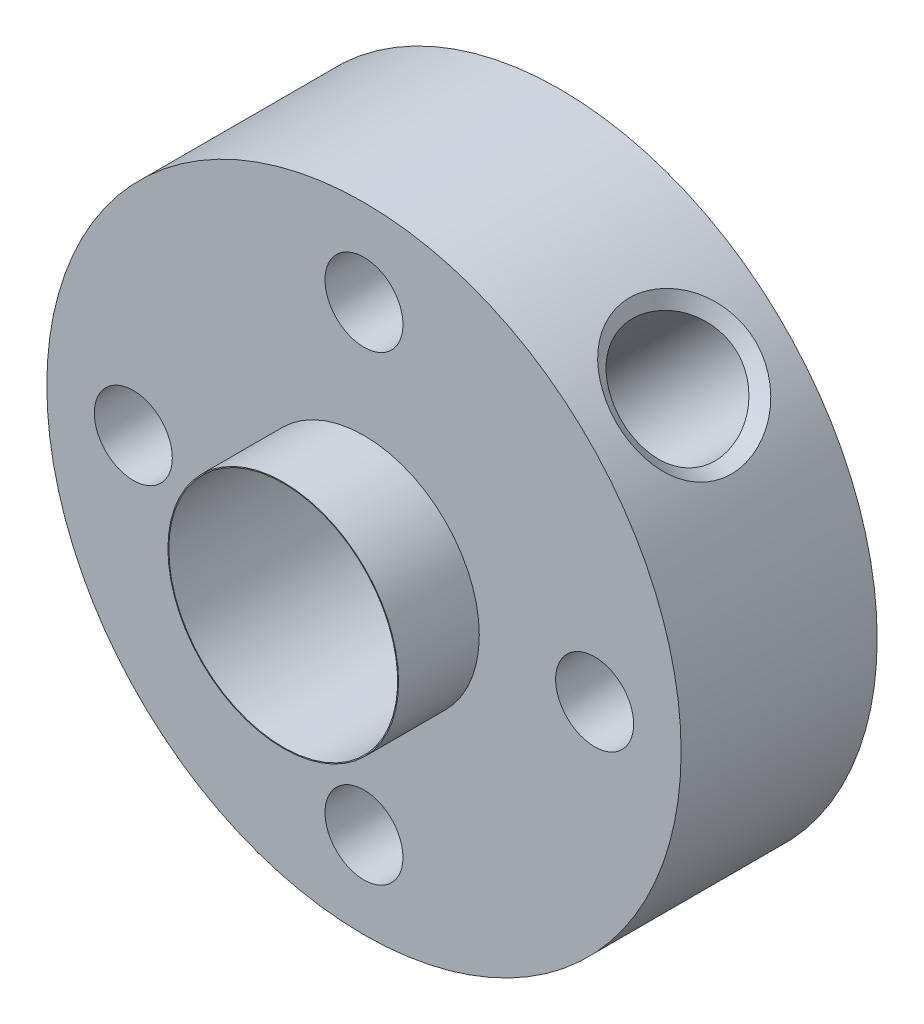
ISO-10303-21;
HEADER;
FILE_DESCRIPTION(('STEP AP214'),'2;1');
FILE_NAME('part.step','',(''),(''),'','','');
FILE_SCHEMA(('AUTOMOTIVE_DESIGN { 1 0 10303 214 1 1 1 1 }'));
ENDSEC;
DATA;
#1=APPLICATION_CONTEXT('core data for automotive mechanical design processes');
#2=APPLICATION_PROTOCOL_DEFINITION('international standard','automotive_design',2000,#1);
#3=PRODUCT_CONTEXT('',#1,'mechanical');
#4=PRODUCT('Part','Part','',(#3));
#5=PRODUCT_RELATED_PRODUCT_CATEGORY('part','',(#4));
#6=PRODUCT_DEFINITION_FORMATION('','',#4);
#7=PRODUCT_DEFINITION_CONTEXT('part definition',#1,'design');
#8=PRODUCT_DEFINITION('design','',#6,#7);
#9=PRODUCT_DEFINITION_SHAPE('','',#8);
#10=(LENGTH_UNIT() NAMED_UNIT(*) SI_UNIT(.MILLI.,.METRE.));
#11=(NAMED_UNIT(*) PLANE_ANGLE_UNIT() SI_UNIT($,.RADIAN.));
#12=(NAMED_UNIT(*) SI_UNIT($,.STERADIAN.) SOLID_ANGLE_UNIT());
#13=UNCERTAINTY_MEASURE_WITH_UNIT(LENGTH_MEASURE(1.E-05),#10,'distance_accuracy_value','');
#14=(GEOMETRIC_REPRESENTATION_CONTEXT(3) GLOBAL_UNCERTAINTY_ASSIGNED_CONTEXT((#13)) GLOBAL_UNIT_ASSIGNED_CONTEXT((#10,
#11,#12)) REPRESENTATION_CONTEXT('',''));
#15=CARTESIAN_POINT('',(0.,0.,0.));
#16=DIRECTION('',(0.,0.,1.));
#17=DIRECTION('',(1.,0.,0.));
#18=AXIS2_PLACEMENT_3D('',#15,#16,#17);
#19=CARTESIAN_POINT('',(0.,0.,3.4));
#20=DIRECTION('',(0.,0.,1.));
#21=DIRECTION('',(1.,0.,0.));
#22=AXIS2_PLACEMENT_3D('',#19,#20,#21);
#23=PLANE('',#22);
#24=CARTESIAN_POINT('',(0.,8.,3.4));
#25=DIRECTION('',(0.,0.,1.));
#26=DIRECTION('',(1.,0.,0.));
#27=AXIS2_PLACEMENT_3D('',#24,#25,#26);
#28=CIRCLE('',#27,1.35254999999999);
#29=CARTESIAN_POINT('',(1.35254999999999,8.,3.4));
#30=VERTEX_POINT('',#29);
#31=EDGE_CURVE('E193',#30,#30,#28,.T.);
#32=ORIENTED_EDGE('',*,*,#31,.F.);
#33=EDGE_LOOP('',(#32));
#34=FACE_BOUND('',#33,.T.);
#35=CARTESIAN_POINT('',(-8.,0.,3.4));
#36=DIRECTION('',(0.,0.,1.));
#37=DIRECTION('',(1.,0.,0.));
#38=AXIS2_PLACEMENT_3D('',#35,#36,#37);
#39=CIRCLE('',#38,1.35254999999999);
#40=CARTESIAN_POINT('',(-6.64745000000001,0.,3.4));
#41=VERTEX_POINT('',#40);
#42=EDGE_CURVE('E170',#41,#41,#39,.T.);
#43=ORIENTED_EDGE('',*,*,#42,.F.);
#44=EDGE_LOOP('',(#43));
#45=FACE_BOUND('',#44,.T.);
#46=CARTESIAN_POINT('',(8.,0.,3.4));
#47=DIRECTION('',(0.,0.,1.));
#48=DIRECTION('',(1.,0.,0.));
#49=AXIS2_PLACEMENT_3D('',#46,#47,#48);
#50=CIRCLE('',#49,1.35254999999999);
#51=CARTESIAN_POINT('',(9.35254999999999,0.,3.4));
#52=VERTEX_POINT('',#51);
#53=EDGE_CURVE('E163',#52,#52,#50,.T.);
#54=ORIENTED_EDGE('',*,*,#53,.F.);
#55=EDGE_LOOP('',(#54));
#56=FACE_BOUND('',#55,.T.);
#57=CARTESIAN_POINT('',(0.,-8.,3.4));
#58=DIRECTION('',(0.,0.,1.));
#59=DIRECTION('',(1.,0.,0.));
#60=AXIS2_PLACEMENT_3D('',#57,#58,#59);
#61=CIRCLE('',#60,1.35254999999999);
#62=CARTESIAN_POINT('',(1.35254999999999,-8.,3.4));
#63=VERTEX_POINT('',#62);
#64=EDGE_CURVE('E168',#63,#63,#61,.T.);
#65=ORIENTED_EDGE('',*,*,#64,.F.);
#66=EDGE_LOOP('',(#65));
#67=FACE_BOUND('',#66,.T.);
#68=CARTESIAN_POINT('',(0.,0.,3.4));
#69=DIRECTION('',(0.,0.,1.));
#70=DIRECTION('',(1.,0.,0.));
#71=AXIS2_PLACEMENT_3D('',#68,#69,#70);
#72=CIRCLE('',#71,11.);
#73=CARTESIAN_POINT('',(11.,0.,3.4));
#74=VERTEX_POINT('',#73);
#75=EDGE_CURVE('E60',#74,#74,#72,.T.);
#76=ORIENTED_EDGE('',*,*,#75,.T.);
#77=EDGE_LOOP('',(#76));
#78=FACE_BOUND('',#77,.T.);
#79=CARTESIAN_POINT('',(0.,0.,3.4));
#80=DIRECTION('',(0.,0.,1.));
#81=DIRECTION('',(1.,0.,0.));
#82=AXIS2_PLACEMENT_3D('',#79,#80,#81);
#83=CIRCLE('',#82,4.);
#84=CARTESIAN_POINT('',(4.,0.,3.4));
#85=VERTEX_POINT('',#84);
#86=EDGE_CURVE('E68',#85,#85,#83,.T.);
#87=ORIENTED_EDGE('',*,*,#86,.F.);
#88=EDGE_LOOP('',(#87));
#89=FACE_BOUND('',#88,.T.);
#90=ADVANCED_FACE('F35',(#34,#45,#56,#67,#78,#89),#23,.T.);
#91=CARTESIAN_POINT('',(0.,0.,-3.4));
#92=DIRECTION('',(0.,0.,1.));
#93=DIRECTION('',(1.,0.,0.));
#94=AXIS2_PLACEMENT_3D('',#91,#92,#93);
#95=CYLINDRICAL_SURFACE('',#94,11.);
#96=CARTESIAN_POINT('',(5.80850921114971,9.34137145948008,0.));
#97=CARTESIAN_POINT('',(5.80860175270186,9.34130684226353,0.637752239425181));
#98=CARTESIAN_POINT('',(6.04841944563921,9.19795689630477,1.26506432985481));
#99=CARTESIAN_POINT('',(6.80772994268232,8.6547578245762,2.1593530444314));
#100=CARTESIAN_POINT('',(7.31255506753503,8.24383991985221,2.42181611028022));
#101=CARTESIAN_POINT('',(8.24208780154512,7.31421539613681,2.42137394363942));
#102=CARTESIAN_POINT('',(8.65342910417239,6.80927509037896,2.16023058528547));
#103=CARTESIAN_POINT('',(9.19833006953286,6.04820111625001,1.26575073384544));
#104=CARTESIAN_POINT('',(9.34130756360716,5.80859981124356,0.640244269694806));
#105=CARTESIAN_POINT('',(9.34143535072448,5.80841861849953,-0.63996115444348));
#106=CARTESIAN_POINT('',(9.19862099961548,6.04773368941902,-1.26485137218771));
#107=CARTESIAN_POINT('',(8.65403117260026,6.8085025567722,-2.15966842361701));
#108=CARTESIAN_POINT('',(8.24214650834189,7.31418190369821,-2.42143639363606));
#109=CARTESIAN_POINT('',(7.31242801405934,8.24394174367863,-2.42175361413118));
#110=CARTESIAN_POINT('',(6.80825671047602,8.65433029295559,-2.15959971653594));
#111=CARTESIAN_POINT('',(6.04869975760828,9.19780320357039,-1.26576913530237));
#112=CARTESIAN_POINT('',(5.80841666959755,9.34143607669663,-0.637752239425181));
#113=CARTESIAN_POINT('',(5.80850921114971,9.34137145948008,0.));
#114=B_SPLINE_CURVE_WITH_KNOTS('',3,(#96,#97,#98,#99,#100,#101,#102,#103,#104,#105,#106,#107,
#108,#109,#110,#111,#112,#113),.UNSPECIFIED.,.T.,.F.,(4,2,2,2,2,2,2,2,4),(-3.18999496817969E-06,
0.00189587305523978,0.00379493610544773,0.00569399915565569,0.00759306220586365,
0.0094921252560716,0.0113911883062796,0.0132902513564875,0.0151893144066955),.UNSPECIFIED.);
#115=CARTESIAN_POINT('',(5.80850921114971,9.34137145948008,0.));
#116=VERTEX_POINT('',#115);
#117=EDGE_CURVE('E10',#116,#116,#114,.F.);
#118=ORIENTED_EDGE('',*,*,#117,.T.);
#119=EDGE_LOOP('',(#118));
#120=FACE_BOUND('',#119,.T.);
#121=CARTESIAN_POINT('',(0.,0.,-3.4));
#122=DIRECTION('',(0.,0.,1.));
#123=DIRECTION('',(1.,0.,0.));
#124=AXIS2_PLACEMENT_3D('',#121,#122,#123);
#125=CIRCLE('',#124,11.);
#126=CARTESIAN_POINT('',(11.,0.,-3.4));
#127=VERTEX_POINT('',#126);
#128=EDGE_CURVE('E55',#127,#127,#125,.T.);
#129=ORIENTED_EDGE('',*,*,#128,.T.);
#130=EDGE_LOOP('',(#129));
#131=FACE_BOUND('',#130,.T.);
#132=ORIENTED_EDGE('',*,*,#75,.F.);
#133=EDGE_LOOP('',(#132));
#134=FACE_BOUND('',#133,.T.);
#135=ADVANCED_FACE('F99',(#120,#131,#134),#95,.T.);
#136=CARTESIAN_POINT('',(0.,0.,-3.4));
#137=DIRECTION('',(0.,0.,1.));
#138=DIRECTION('',(1.,0.,0.));
#139=AXIS2_PLACEMENT_3D('',#136,#137,#138);
#140=PLANE('',#139);
#141=CARTESIAN_POINT('',(0.,0.,-3.4));
#142=DIRECTION('',(0.,0.,-1.));
#143=DIRECTION('',(-1.,0.,0.));
#144=AXIS2_PLACEMENT_3D('',#141,#142,#143);
#145=CIRCLE('',#144,3.96875);
#146=CARTESIAN_POINT('',(-3.96875,0.,-3.4));
#147=VERTEX_POINT('',#146);
#148=EDGE_CURVE('E199',#147,#147,#145,.T.);
#149=ORIENTED_EDGE('',*,*,#148,.F.);
#150=EDGE_LOOP('',(#149));
#151=FACE_BOUND('',#150,.T.);
#152=CARTESIAN_POINT('',(0.,8.,-3.4));
#153=DIRECTION('',(0.,0.,1.));
#154=DIRECTION('',(1.,0.,0.));
#155=AXIS2_PLACEMENT_3D('',#152,#153,#154);
#156=CIRCLE('',#155,1.35255);
#157=CARTESIAN_POINT('',(1.35255,8.,-3.4));
#158=VERTEX_POINT('',#157);
#159=EDGE_CURVE('E196',#158,#158,#156,.T.);
#160=ORIENTED_EDGE('',*,*,#159,.T.);
#161=EDGE_LOOP('',(#160));
#162=FACE_BOUND('',#161,.T.);
#163=CARTESIAN_POINT('',(-8.,0.,-3.4));
#164=DIRECTION('',(0.,0.,1.));
#165=DIRECTION('',(1.,0.,0.));
#166=AXIS2_PLACEMENT_3D('',#163,#164,#165);
#167=CIRCLE('',#166,1.35255);
#168=CARTESIAN_POINT('',(-6.64745,0.,-3.4));
#169=VERTEX_POINT('',#168);
#170=EDGE_CURVE('E190',#169,#169,#167,.T.);
#171=ORIENTED_EDGE('',*,*,#170,.T.);
#172=EDGE_LOOP('',(#171));
#173=FACE_BOUND('',#172,.T.);
#174=CARTESIAN_POINT('',(8.,0.,-3.4));
#175=DIRECTION('',(0.,0.,1.));
#176=DIRECTION('',(1.,0.,0.));
#177=AXIS2_PLACEMENT_3D('',#174,#175,#176);
#178=CIRCLE('',#177,1.35255);
#179=CARTESIAN_POINT('',(9.35255,0.,-3.4));
#180=VERTEX_POINT('',#179);
#181=EDGE_CURVE('E160',#180,#180,#178,.T.);
#182=ORIENTED_EDGE('',*,*,#181,.T.);
#183=EDGE_LOOP('',(#182));
#184=FACE_BOUND('',#183,.T.);
#185=CARTESIAN_POINT('',(0.,-8.,-3.4));
#186=DIRECTION('',(0.,0.,1.));
#187=DIRECTION('',(1.,0.,0.));
#188=AXIS2_PLACEMENT_3D('',#185,#186,#187);
#189=CIRCLE('',#188,1.35255);
#190=CARTESIAN_POINT('',(1.35255,-8.,-3.4));
#191=VERTEX_POINT('',#190);
#192=EDGE_CURVE('E165',#191,#191,#189,.T.);
#193=ORIENTED_EDGE('',*,*,#192,.T.);
#194=EDGE_LOOP('',(#193));
#195=FACE_BOUND('',#194,.T.);
#196=ORIENTED_EDGE('',*,*,#128,.F.);
#197=EDGE_LOOP('',(#196));
#198=FACE_BOUND('',#197,.T.);
#199=ADVANCED_FACE('F95',(#151,#162,#173,#184,#195,#198),#140,.F.);
#200=CARTESIAN_POINT('',(0.,0.,6.2));
#201=DIRECTION('',(0.,0.,-1.));
#202=DIRECTION('',(-1.,0.,0.));
#203=AXIS2_PLACEMENT_3D('',#200,#201,#202);
#204=CYLINDRICAL_SURFACE('',#203,4.);
#205=CARTESIAN_POINT('',(0.,0.,6.2));
#206=DIRECTION('',(0.,0.,1.));
#207=DIRECTION('',(1.,0.,0.));
#208=AXIS2_PLACEMENT_3D('',#205,#206,#207);
#209=CIRCLE('',#208,4.);
#210=CARTESIAN_POINT('',(4.,0.,6.2));
#211=VERTEX_POINT('',#210);
#212=EDGE_CURVE('E65',#211,#211,#209,.T.);
#213=ORIENTED_EDGE('',*,*,#212,.F.);
#214=EDGE_LOOP('',(#213));
#215=FACE_BOUND('',#214,.T.);
#216=ORIENTED_EDGE('',*,*,#86,.T.);
#217=EDGE_LOOP('',(#216));
#218=FACE_BOUND('',#217,.T.);
#219=ADVANCED_FACE('F91',(#215,#218),#204,.T.);
#220=CARTESIAN_POINT('',(0.,0.,6.2));
#221=DIRECTION('',(0.,0.,1.));
#222=DIRECTION('',(1.,0.,0.));
#223=AXIS2_PLACEMENT_3D('',#220,#221,#222);
#224=PLANE('',#223);
#225=CARTESIAN_POINT('',(0.,0.,6.2));
#226=DIRECTION('',(0.,0.,-1.));
#227=DIRECTION('',(-1.,0.,0.));
#228=AXIS2_PLACEMENT_3D('',#225,#226,#227);
#229=CIRCLE('',#228,3.96875);
#230=CARTESIAN_POINT('',(-3.96875,0.,6.2));
#231=VERTEX_POINT('',#230);
#232=EDGE_CURVE('E202',#231,#231,#229,.T.);
#233=ORIENTED_EDGE('',*,*,#232,.T.);
#234=EDGE_LOOP('',(#233));
#235=FACE_BOUND('',#234,.T.);
#236=ORIENTED_EDGE('',*,*,#212,.T.);
#237=EDGE_LOOP('',(#236));
#238=FACE_BOUND('',#237,.T.);
#239=ADVANCED_FACE('F85',(#235,#238),#224,.T.);
#240=CARTESIAN_POINT('',(7.77817459305204,7.77817459305201,0.));
#241=DIRECTION('',(0.707106781186549,0.707106781186546,0.));
#242=DIRECTION('',(-0.707106781186546,0.707106781186549,0.));
#243=AXIS2_PLACEMENT_3D('',#240,#241,#242);
#244=CYLINDRICAL_SURFACE('',#243,2.01929999999999);
#245=CARTESIAN_POINT('',(0.988066021552105,3.84378746805208,0.));
#246=CARTESIAN_POINT('',(0.988079902541116,3.84378895007629,-0.104927856551473));
#247=CARTESIAN_POINT('',(0.997359113943263,3.84143565622422,-0.209985951877966));
#248=CARTESIAN_POINT('',(1.0336680659886,3.83181885188441,-0.416851766777405));
#249=CARTESIAN_POINT('',(1.06073378291078,3.82454538862704,-0.518652459109407));
#250=CARTESIAN_POINT('',(1.13022299693377,3.80458397320029,-0.715620498990883));
#251=CARTESIAN_POINT('',(1.17256250905059,3.79192556393313,-0.810820791319396));
#252=CARTESIAN_POINT('',(1.26993094348076,3.7604338013933,-0.993320316996598));
#253=CARTESIAN_POINT('',(1.32496093160809,3.7415999294162,-1.08061888585833));
#254=CARTESIAN_POINT('',(1.4502174154329,3.6949530461915,-1.25308159207338));
#255=CARTESIAN_POINT('',(1.52134137800284,3.66650955234386,-1.33742373732139));
#256=CARTESIAN_POINT('',(1.6723052454782,3.60016282906435,-1.49374573019937));
#257=CARTESIAN_POINT('',(1.75214959794203,3.56225475973178,-1.56571922097949));
#258=CARTESIAN_POINT('',(1.92334854127002,3.47298942710685,-1.70022656254003));
#259=CARTESIAN_POINT('',(2.0151177350485,3.42087311221871,-1.76173889279822));
#260=CARTESIAN_POINT('',(2.20120105356201,3.30419656521406,-1.86639760992893));
#261=CARTESIAN_POINT('',(2.29551347325045,3.23964450033303,-1.90955599149708));
#262=CARTESIAN_POINT('',(2.47562329768691,3.10387451128039,-1.97299149618751));
#263=CARTESIAN_POINT('',(2.56153840302111,3.03349117405402,-1.99471305588314));
#264=CARTESIAN_POINT('',(2.72850970041959,2.88421930798347,-2.01942570035066));
#265=CARTESIAN_POINT('',(2.80956892130637,2.80533616861374,-2.02242858381395));
#266=CARTESIAN_POINT('',(2.95694466876338,2.64914129463903,-2.01015199009899));
#267=CARTESIAN_POINT('',(3.02393145385512,2.57232673696917,-1.99649311009036));
#268=CARTESIAN_POINT('',(3.14995684203534,2.41636142335379,-1.95419547289651));
#269=CARTESIAN_POINT('',(3.20899484801796,2.33721049244571,-1.92555559113911));
#270=CARTESIAN_POINT('',(3.31908779594535,2.17810180971991,-1.85395095981867));
#271=CARTESIAN_POINT('',(3.37002491830902,2.09814749264745,-1.81079905149489));
#272=CARTESIAN_POINT('',(3.46290403064263,1.94103413705174,-1.71166853890331));
#273=CARTESIAN_POINT('',(3.50484283192848,1.86387609745267,-1.65568540219259));
#274=CARTESIAN_POINT('',(3.58382388815285,1.70750678416115,-1.5262546139572));
#275=CARTESIAN_POINT('',(3.6199970261924,1.62882188057161,-1.45163987808151));
#276=CARTESIAN_POINT('',(3.68305818293236,1.48072646230621,-1.2901734015466));
#277=CARTESIAN_POINT('',(3.70993863236889,1.41132353624781,-1.20331176599065));
#278=CARTESIAN_POINT('',(3.75708089385763,1.28080324032226,-1.01266300006346));
#279=CARTESIAN_POINT('',(3.77677370342606,1.2205609670457,-0.908129278653181));
#280=CARTESIAN_POINT('',(3.80819276088697,1.11871027030587,-0.689253213204129));
#281=CARTESIAN_POINT('',(3.8199275534277,1.07708187724419,-0.5749215384806));
#282=CARTESIAN_POINT('',(3.83586302371067,1.01881432623523,-0.34929245092863));
#283=CARTESIAN_POINT('',(3.84059152655263,1.00044180772154,-0.238484555747577));
#284=CARTESIAN_POINT('',(3.84467034847992,0.984666788253275,-0.0153190940584517));
#285=CARTESIAN_POINT('',(3.84402479071221,0.987248210743565,0.0970372183887347));
#286=CARTESIAN_POINT('',(3.83768926688075,1.01154768021783,0.306285889223869));
#287=CARTESIAN_POINT('',(3.83258914996281,1.03102629884983,0.403468276542668));
#288=CARTESIAN_POINT('',(3.81777315440258,1.08459721795761,0.593338244190524));
#289=CARTESIAN_POINT('',(3.80805571029018,1.11869447438943,0.686024288313387));
#290=CARTESIAN_POINT('',(3.78285711500173,1.2012088615821,0.869141295505289));
#291=CARTESIAN_POINT('',(3.76713121285843,1.25021297597341,0.959271996815907));
#292=CARTESIAN_POINT('',(3.72917596633653,1.35924768170892,1.13110010124883));
#293=CARTESIAN_POINT('',(3.70694326990453,1.4192839504532,1.21279312818116));
#294=CARTESIAN_POINT('',(3.65168327891227,1.55638441929068,1.37666632676823));
#295=CARTESIAN_POINT('',(3.61762119365603,1.63464956857404,1.45749894372438));
#296=CARTESIAN_POINT('',(3.5388740045432,1.79878642690377,1.60513146946906));
#297=CARTESIAN_POINT('',(3.49418491253164,1.88466098403699,1.6719260922397));
#298=CARTESIAN_POINT('',(3.39186160946718,2.06328504915796,1.7913214795364));
#299=CARTESIAN_POINT('',(3.33387882619923,2.15616359207096,1.8434355346827));
#300=CARTESIAN_POINT('',(3.20579420795771,2.34234537613327,1.928449225566));
#301=CARTESIAN_POINT('',(3.13570345543774,2.43564815359813,1.96136631281111));
#302=CARTESIAN_POINT('',(2.99180655270109,2.60990913364403,2.00412288627952));
#303=CARTESIAN_POINT('',(2.91896496918987,2.69120453013022,2.01583680402984));
#304=CARTESIAN_POINT('',(2.76644500483723,2.84775021696145,2.02143522084023));
#305=CARTESIAN_POINT('',(2.686769207402,2.92300277091989,2.01532642849873));
#306=CARTESIAN_POINT('',(2.52910686050123,3.06019007046344,1.98666783402269));
#307=CARTESIAN_POINT('',(2.45139014021031,3.1226876327281,1.96529456057147));
#308=CARTESIAN_POINT('',(2.29496968590167,3.23938550840543,1.90833748226343));
#309=CARTESIAN_POINT('',(2.21626581647025,3.29358466970137,1.87275170667011));
#310=CARTESIAN_POINT('',(2.05709684530155,3.39538335267928,1.78685660207556));
#311=CARTESIAN_POINT('',(1.97669508431021,3.44261359261191,1.73599535996841));
#312=CARTESIAN_POINT('',(1.82009903391039,3.52791441376144,1.62168189898446));
#313=CARTESIAN_POINT('',(1.74390668086039,3.56598080613233,1.55822394617094));
#314=CARTESIAN_POINT('',(1.59073453119501,3.63708393211849,1.41297927787462));
#315=CARTESIAN_POINT('',(1.51447512494284,3.66920466515798,1.32998035162024));
#316=CARTESIAN_POINT('',(1.37341431743566,3.72430605957277,1.1519500326916));
#317=CARTESIAN_POINT('',(1.30862369799624,3.74727814538314,1.05690746026233));
#318=CARTESIAN_POINT('',(1.19205946451786,3.78601440655319,0.852732732091955));
#319=CARTESIAN_POINT('',(1.14085832928895,3.80147936469973,0.743208524542079));
#320=CARTESIAN_POINT('',(1.07955124122097,3.81916083666133,0.573071983833453));
#321=CARTESIAN_POINT('',(1.0617070600374,3.82413333843385,0.51543906059989));
#322=CARTESIAN_POINT('',(1.03157037760657,3.83237342500356,0.398634079647874));
#323=CARTESIAN_POINT('',(1.01927404506659,3.83564218663078,0.339463114045018));
#324=CARTESIAN_POINT('',(1.00268476754273,3.84000721976838,0.233567736576123));
#325=CARTESIAN_POINT('',(0.997213623023875,3.8414268032206,0.187038031107454));
#326=CARTESIAN_POINT('',(0.989901029667684,3.84331662818391,0.09368088626919));
#327=CARTESIAN_POINT('',(0.988059823275215,3.84378680628393,0.0468534272220681));
#328=CARTESIAN_POINT('',(0.988066021552105,3.84378746805208,0.));
#329=B_SPLINE_CURVE_WITH_KNOTS('',3,(#245,#246,#247,#248,#249,#250,#251,#252,#253,#254,#255,
#256,#257,#258,#259,#260,#261,#262,#263,#264,#265,#266,#267,#268,#269,#270,#271,#272,#273,#274,
#275,#276,#277,#278,#279,#280,#281,#282,#283,#284,#285,#286,#287,#288,#289,#290,#291,#292,#293,
#294,#295,#296,#297,#298,#299,#300,#301,#302,#303,#304,#305,#306,#307,#308,#309,#310,#311,#312,
#313,#314,#315,#316,#317,#318,#319,#320,#321,#322,#323,#324,#325,#326,#327,#328),.UNSPECIFIED.,
.T.,.F.,(4,2,2,2,2,2,2,2,2,2,2,2,2,2,2,2,2,2,2,2,2,2,2,2,2,2,2,2,2,2,2,2,2,2,2,2,2,2,2,2,2,4),
(0.,0.314593776156156,0.629825839217224,0.943350337013717,1.25690117586846,1.59728492965321,
1.93784310329725,2.30238105637919,2.66668040869054,3.00429585897964,3.34169848312726,
3.64874422629698,3.95581302164109,4.26700442383124,4.57830591968884,4.91979290400179,
5.26155739123993,5.62638332394284,5.99081691444654,6.32608302237147,6.66109192739968,
6.95749709235776,7.25400282304617,7.56415893350387,7.8744751067143,8.22558245452992,
8.57682177615261,8.9386132974231,9.30007540784798,9.62764581054904,9.95509292926405,
10.2596996913262,10.5643487054978,10.8816969366481,11.199189955173,11.549239007761,
11.8996154139391,12.2629980465975,12.4443643777116,12.6256052664879,12.7660714182122,
12.9065469514031),.UNSPECIFIED.);
#330=CARTESIAN_POINT('',(0.988066021552105,3.84378746805208,0.));
#331=VERTEX_POINT('',#330);
#332=EDGE_CURVE('E42',#331,#331,#329,.T.);
#333=ORIENTED_EDGE('',*,*,#332,.T.);
#334=EDGE_LOOP('',(#333));
#335=FACE_BOUND('',#334,.T.);
#336=CARTESIAN_POINT('',(5.91506401697902,8.77078546347897,0.));
#337=CARTESIAN_POINT('',(5.91505848231522,8.77078895441069,-0.0332110676748999));
#338=CARTESIAN_POINT('',(5.91584250371787,8.77036908136088,-0.0664205027333981));
#339=CARTESIAN_POINT('',(5.91894801804012,8.7686844720424,-0.132706000824386));
#340=CARTESIAN_POINT('',(5.9212676546673,8.76742075581777,-0.165782176435799));
#341=CARTESIAN_POINT('',(5.92740096477233,8.76405141279832,-0.231730396913026));
#342=CARTESIAN_POINT('',(5.93121367555311,8.7619463284787,-0.264602559475331));
#343=CARTESIAN_POINT('',(5.94028892447994,8.75689761117119,-0.33007339450581));
#344=CARTESIAN_POINT('',(5.94555114052323,8.7539541644756,-0.362672126078199));
#345=CARTESIAN_POINT('',(5.95748172497235,8.74723181556498,-0.427526437618046));
#346=CARTESIAN_POINT('',(5.96415019887331,8.74345285066972,-0.45978199165009));
#347=CARTESIAN_POINT('',(5.97884975539384,8.73506249034032,-0.523880394046921));
#348=CARTESIAN_POINT('',(5.9868811988934,8.73045087442044,-0.55572313069829));
#349=CARTESIAN_POINT('',(6.00426333819006,8.72039813550142,-0.618926309415734));
#350=CARTESIAN_POINT('',(6.01361451659092,8.71495670899628,-0.650286570375661));
#351=CARTESIAN_POINT('',(6.03359289306655,8.70324720139475,-0.712455190591757));
#352=CARTESIAN_POINT('',(6.04422059736454,8.69697879224988,-0.743263325292279));
#353=CARTESIAN_POINT('',(6.0667088867097,8.68361811087547,-0.804258051751251));
#354=CARTESIAN_POINT('',(6.07856993563722,8.67652552854269,-0.834444404496169));
#355=CARTESIAN_POINT('',(6.10348184418441,8.66151925847353,-0.894125891486483));
#356=CARTESIAN_POINT('',(6.11653308800739,8.65360530547822,-0.923620798638439));
#357=CARTESIAN_POINT('',(6.1437823270195,8.63695899466251,-0.981849692064878));
#358=CARTESIAN_POINT('',(6.15798061459985,8.62822642807899,-1.01058348182968));
#359=CARTESIAN_POINT('',(6.18748098358666,8.60994569245589,-1.0672204054046));
#360=CARTESIAN_POINT('',(6.20278327541986,8.60039736786602,-1.09512337941919));
#361=CARTESIAN_POINT('',(6.23444834486616,8.58048749877547,-1.15002897367341));
#362=CARTESIAN_POINT('',(6.25081127954805,8.57012583378044,-1.1770314596605));
#363=CARTESIAN_POINT('',(6.28455556770698,8.54859326407029,-1.23006622575013));
#364=CARTESIAN_POINT('',(6.30193706947595,8.53742224146554,-1.25609836367373));
#365=CARTESIAN_POINT('',(6.33767164204863,8.51426907303072,-1.30712323462615));
#366=CARTESIAN_POINT('',(6.35602490834891,8.50228676385234,-1.33211575668861));
#367=CARTESIAN_POINT('',(6.39367379710447,8.47753119815555,-1.38098995191832));
#368=CARTESIAN_POINT('',(6.41296973283743,8.46475767831074,-1.40487125057306));
#369=CARTESIAN_POINT('',(6.45239380966424,8.43836765389059,-1.45144277207452));
#370=CARTESIAN_POINT('',(6.47252179241437,8.42475130946692,-1.47413321969915));
#371=CARTESIAN_POINT('',(6.51347588006849,8.39664993352501,-1.51827896365428));
#372=CARTESIAN_POINT('',(6.53430150189428,8.38216549784592,-1.53973508781516));
#373=CARTESIAN_POINT('',(6.57659692078657,8.35237560191873,-1.58137915482344));
#374=CARTESIAN_POINT('',(6.59806639414691,8.33707055129587,-1.60156771966927));
#375=CARTESIAN_POINT('',(6.64157796071985,8.30566497179513,-1.6406458230446));
#376=CARTESIAN_POINT('',(6.66361982921346,8.28956475292207,-1.65953586105512));
#377=CARTESIAN_POINT('',(6.70820943365554,8.25660020779171,-1.69598536565465));
#378=CARTESIAN_POINT('',(6.73075699607695,8.23973614168033,-1.71354527988382));
#379=CARTESIAN_POINT('',(6.77629000761415,8.20527364445819,-1.74730308237523));
#380=CARTESIAN_POINT('',(6.79927530942779,8.18767545809095,-1.76350141922007));
#381=CARTESIAN_POINT('',(6.84561618019305,8.15177485327989,-1.79450451369917));
#382=CARTESIAN_POINT('',(6.86897161775489,8.13347268158226,-1.80930975345407));
#383=CARTESIAN_POINT('',(6.915985056941,8.09619410943874,-1.8374950782937));
#384=CARTESIAN_POINT('',(6.93964294335845,8.07721796109372,-1.8508756889275));
#385=CARTESIAN_POINT('',(6.98719359976604,8.03862146663374,-1.87618016635322));
#386=CARTESIAN_POINT('',(7.01108627669854,8.01900136905856,-1.88810458698167));
#387=CARTESIAN_POINT('',(7.05903882080187,7.97914700798319,-1.91046511062842));
#388=CARTESIAN_POINT('',(7.08309862402777,7.95891297037338,-1.92090175318898));
#389=CARTESIAN_POINT('',(7.13131772267692,7.91786078233943,-1.94025519102211));
#390=CARTESIAN_POINT('',(7.15547698625861,7.89704280807244,-1.94917243903047));
#391=CARTESIAN_POINT('',(7.20382730656836,7.85485282469413,-1.96545562647138));
#392=CARTESIAN_POINT('',(7.2280183572575,7.83348090947038,-1.97282182688519));
#393=CARTESIAN_POINT('',(7.27636455934795,7.7902131575659,-1.9859715835014));
#394=CARTESIAN_POINT('',(7.30051970910261,7.76831729759627,-1.99175506921085));
#395=CARTESIAN_POINT('',(7.34872645183661,7.72403178920513,-2.0017081311534));
#396=CARTESIAN_POINT('',(7.37277800466266,7.70164196687641,-2.00587712907822));
#397=CARTESIAN_POINT('',(7.42070990754527,7.65639875033492,-2.01257039611203));
#398=CARTESIAN_POINT('',(7.4445901076154,7.63354500443548,-2.01509336544913));
#399=CARTESIAN_POINT('',(7.49211187188735,7.58740398851408,-2.01846297530972));
#400=CARTESIAN_POINT('',(7.51575306944566,7.56411617370422,-2.01930734284276));
#401=CARTESIAN_POINT('',(7.56268537381162,7.51718143523515,-2.01929214610317));
#402=CARTESIAN_POINT('',(7.58597640723568,7.49353443833364,-2.01843222954557));
#403=CARTESIAN_POINT('',(7.63213269087667,7.44599278654124,-2.01503739250119));
#404=CARTESIAN_POINT('',(7.65499833438957,7.4220983958268,-2.01250410727608));
#405=CARTESIAN_POINT('',(7.70027314745174,7.37413068840907,-2.00579376995032));
#406=CARTESIAN_POINT('',(7.7226825250674,7.35005746041973,-2.00161748558656));
#407=CARTESIAN_POINT('',(7.76701398076268,7.30180085174933,-1.99165308065752));
#408=CARTESIAN_POINT('',(7.78893610238858,7.27761748114641,-1.98586510476038));
#409=CARTESIAN_POINT('',(7.83226222533887,7.22920923113276,-1.97270874422235));
#410=CARTESIAN_POINT('',(7.85366613690357,7.2049843452983,-1.96534008793903));
#411=CARTESIAN_POINT('',(7.89592497299628,7.1565616692253,-1.94905366064103));
#412=CARTESIAN_POINT('',(7.91677971060388,7.13236389082918,-1.94013536983414));
#413=CARTESIAN_POINT('',(7.95790929380115,7.08406400516904,-1.92078078423956));
#414=CARTESIAN_POINT('',(7.97818389178885,7.05996194242694,-1.91034385253155));
#415=CARTESIAN_POINT('',(8.01812224950333,7.01192205696619,-1.88798297317344));
#416=CARTESIAN_POINT('',(8.03778573410585,6.98798431189646,-1.87605836754498));
#417=CARTESIAN_POINT('',(8.07647088550343,6.94034163726294,-1.85075303378894));
#418=CARTESIAN_POINT('',(8.09549227656628,6.9166368107419,-1.83737169026327));
#419=CARTESIAN_POINT('',(8.13286222382865,6.86952855499725,-1.80918371284058));
#420=CARTESIAN_POINT('',(8.15121052192307,6.84612524357941,-1.79437653992198));
#421=CARTESIAN_POINT('',(8.18720327904013,6.79968863480246,-1.76336770394078));
#422=CARTESIAN_POINT('',(8.20484750501893,6.77665546143919,-1.74716558467095));
#423=CARTESIAN_POINT('',(8.23940098478744,6.73102767566809,-1.71339764848219));
#424=CARTESIAN_POINT('',(8.25631002512714,6.70843319166702,-1.69583143959049));
#425=CARTESIAN_POINT('',(8.28936245658593,6.6637516328335,-1.65936614329798));
#426=CARTESIAN_POINT('',(8.30550563361525,6.6416647007617,-1.64046668682979));
#427=CARTESIAN_POINT('',(8.33699399859716,6.59806596681262,-1.6013657262551));
#428=CARTESIAN_POINT('',(8.35233893380897,6.57655434812705,-1.5811638142422));
#429=CARTESIAN_POINT('',(8.38220479917344,6.53417810328664,-1.53948894405403));
#430=CARTESIAN_POINT('',(8.39672538327564,6.51331375048718,-1.51801545970707));
#431=CARTESIAN_POINT('',(8.42489311596826,6.4722882785207,-1.47382811571226));
#432=CARTESIAN_POINT('',(8.43853973376537,6.45212759003505,-1.45111351751843));
#433=CARTESIAN_POINT('',(8.46498311220623,6.41264578919864,-1.40450223516731));
#434=CARTESIAN_POINT('',(8.47778006619722,6.39332448618789,-1.38060582211521));
#435=CARTESIAN_POINT('',(8.50257514167932,6.35563320480252,-1.33172197410269));
#436=CARTESIAN_POINT('',(8.51457408105177,6.33726225684295,-1.30673570103524));
#437=CARTESIAN_POINT('',(8.5377528699454,6.3015013268,-1.25573829303499));
#438=CARTESIAN_POINT('',(8.54893337535542,6.28411056183228,-1.22972800503158));
#439=CARTESIAN_POINT('',(8.57047851389438,6.25035520776226,-1.17674891016928));
#440=CARTESIAN_POINT('',(8.58084366898023,6.23398996354728,-1.14978073283482));
#441=CARTESIAN_POINT('',(8.60075497666371,6.20232675855256,-1.09495202742266));
#442=CARTESIAN_POINT('',(8.61030156068651,6.18702823636469,-1.06709198016873));
#443=CARTESIAN_POINT('',(8.62857424193247,6.15754073429502,-1.01054566085374));
#444=CARTESIAN_POINT('',(8.6373007052626,6.14335125980823,-0.98185976499947));
#445=CARTESIAN_POINT('',(8.65393118322941,6.1161238432409,-0.923727827713149));
#446=CARTESIAN_POINT('',(8.66183551201453,6.10308546160267,-0.894282082037694));
#447=CARTESIAN_POINT('',(8.67681986647411,6.07820231388729,-0.834696503956042));
#448=CARTESIAN_POINT('',(8.68390015394206,6.06635716888693,-0.804556895651193));
#449=CARTESIAN_POINT('',(8.69723453927415,6.04390255145558,-0.743649643103456));
#450=CARTESIAN_POINT('',(8.70348883246057,6.03329278696552,-0.712882149330113));
#451=CARTESIAN_POINT('',(8.71516936551008,6.01335096704361,-0.65078517879946));
#452=CARTESIAN_POINT('',(8.72059570606081,6.00401875626215,-0.619455770895438));
#453=CARTESIAN_POINT('',(8.73061849592326,5.98667402839745,-0.556301032430913));
#454=CARTESIAN_POINT('',(8.73521490889622,5.97866156910146,-0.524475680221509));
#455=CARTESIAN_POINT('',(8.74357604893016,5.96399825071929,-0.460395119679624));
#456=CARTESIAN_POINT('',(8.74734054591037,5.95734776834859,-0.428139795039592));
#457=CARTESIAN_POINT('',(8.75403611517923,5.94545020513707,-0.363265361084169));
#458=CARTESIAN_POINT('',(8.75696669272247,5.94020395750586,-0.33064604769755));
#459=CARTESIAN_POINT('',(8.76199275794242,5.93115651464901,-0.265109684300497));
#460=CARTESIAN_POINT('',(8.76408740155927,5.92735678017527,-0.232192367504754));
#461=CARTESIAN_POINT('',(8.76744000846942,5.92124387879349,-0.16612606386624));
#462=CARTESIAN_POINT('',(8.76869668102399,5.91893300538346,-0.132976798738433));
#463=CARTESIAN_POINT('',(8.77037188909036,5.91583898922573,-0.0665124282631985));
#464=CARTESIAN_POINT('',(8.77078857901005,5.9150592106646,-0.0331971186146531));
#465=CARTESIAN_POINT('',(8.77078234422554,5.91506882985746,0.0334354198008879));
#466=CARTESIAN_POINT('',(8.77035936358661,5.91585833214921,0.0667526485478812));
#467=CARTESIAN_POINT('',(8.76867146473501,5.91897238819307,0.133224296589018));
#468=CARTESIAN_POINT('',(8.76740828879689,5.92129376528809,0.166378910068228));
#469=CARTESIAN_POINT('',(8.76404262761878,5.92742794695481,0.23245879572558));
#470=CARTESIAN_POINT('',(8.7619413437847,5.93123861650762,0.265384327842085));
#471=CARTESIAN_POINT('',(8.75690192757777,5.94030819641756,0.330939444120566));
#472=CARTESIAN_POINT('',(8.75396456516732,5.94556577413946,0.363569272205728));
#473=CARTESIAN_POINT('',(8.7472553538668,5.95748617552346,0.428466492217267));
#474=CARTESIAN_POINT('',(8.74348394143914,5.96414826411336,0.460734064467773));
#475=CARTESIAN_POINT('',(8.73510889001523,5.97883490576692,0.52484030722021));
#476=CARTESIAN_POINT('',(8.73050543884059,5.98685915131707,0.556679072780165));
#477=CARTESIAN_POINT('',(8.72046848535581,6.0042274881664,0.619861251959669));
#478=CARTESIAN_POINT('',(8.71503499303039,6.01357156358902,0.651204671532819));
#479=CARTESIAN_POINT('',(8.70334006221748,6.03353707477465,0.713329703342658));
#480=CARTESIAN_POINT('',(8.69707851221821,6.04415868256126,0.744111239275849));
#481=CARTESIAN_POINT('',(8.68372951263668,6.06663687147066,0.805046035453224));
#482=CARTESIAN_POINT('',(8.67664187185277,6.0784937384309,0.835199148335342));
#483=CARTESIAN_POINT('',(8.66164270405434,6.10340013586136,0.894810613656909));
#484=CARTESIAN_POINT('',(8.65373093354436,6.11645001867716,0.924268757591387));
#485=CARTESIAN_POINT('',(8.63708546101234,6.14370016084589,0.982423787635075));
#486=CARTESIAN_POINT('',(8.62835147637857,6.15790081550739,1.01112040761646));
#487=CARTESIAN_POINT('',(8.61006363456531,6.18741031938701,1.06768588347149));
#488=CARTESIAN_POINT('',(8.60050945492705,6.20271960408833,1.09555440793038));
#489=CARTESIAN_POINT('',(8.58058284492023,6.23440387837895,1.15039720437352));
#490=CARTESIAN_POINT('',(8.57021003759893,6.25077935830365,1.17737105617333));
#491=CARTESIAN_POINT('',(8.54864944445045,6.28455467519279,1.23035799961978));
#492=CARTESIAN_POINT('',(8.53746120026439,6.30195508720328,1.25637053833628));
#493=CARTESIAN_POINT('',(8.5142669232988,6.3377345712086,1.30736855221933));
#494=CARTESIAN_POINT('',(8.50226030619904,6.35611434037939,1.33235327267237));
#495=CARTESIAN_POINT('',(8.47744934140314,6.39382294388809,1.38122882200797));
#496=CARTESIAN_POINT('',(8.46464425050445,6.4131526587608,1.40511859474889));
#497=CARTESIAN_POINT('',(8.43818660196547,6.4526481078882,1.45171251711371));
#498=CARTESIAN_POINT('',(8.42453397317264,6.472813912287,1.47441656689831));
#499=CARTESIAN_POINT('',(8.39635830986087,6.51384425532208,1.51858066920913));
#500=CARTESIAN_POINT('',(8.38183596066717,6.53470823823055,1.5400416756681));
#501=CARTESIAN_POINT('',(8.351969724349,6.57707948460711,1.58168918955006));
#502=CARTESIAN_POINT('',(8.33662631249606,6.59858637281448,1.60187641986011));
#503=CARTESIAN_POINT('',(8.30514387938477,6.6421718620316,1.64094629790071));
#504=CARTESIAN_POINT('',(8.28900521800497,6.6642502023302,1.65982952661447));
#505=CARTESIAN_POINT('',(8.25596425137547,6.7089114379051,1.69626108459567));
#506=CARTESIAN_POINT('',(8.23906224475767,6.73149413415179,1.71380992880571));
#507=CARTESIAN_POINT('',(8.20452486185037,6.77709580693245,1.74754235960536));
#508=CARTESIAN_POINT('',(8.1868897618932,6.80011461732841,1.76372645378098));
#509=CARTESIAN_POINT('',(8.15091686836598,6.84652057975221,1.79469895545694));
#510=CARTESIAN_POINT('',(8.13257935010047,6.86990758539569,1.80948790205611));
#511=CARTESIAN_POINT('',(8.09523215855355,6.91698192631167,1.83763964193117));
#512=CARTESIAN_POINT('',(8.07622276636989,6.94066913338687,1.85100302244686));
#513=CARTESIAN_POINT('',(8.03756239098396,6.98827588717756,1.87627314501539));
#514=CARTESIAN_POINT('',(8.01791168882148,7.01219532897691,1.88818051455554));
#515=CARTESIAN_POINT('',(7.97799925524323,7.06019855062092,1.91050813867076));
#516=CARTESIAN_POINT('',(7.95773778839228,7.08428225591072,1.92092902624326));
#517=CARTESIAN_POINT('',(7.91663440543888,7.13254599725071,1.94025324141825));
#518=CARTESIAN_POINT('',(7.89579271257581,7.15672599326698,1.94915714353736));
#519=CARTESIAN_POINT('',(7.85355948229105,7.20511430797543,1.96541702019326));
#520=CARTESIAN_POINT('',(7.83216809594916,7.22932261717638,1.97277341505298));
#521=CARTESIAN_POINT('',(7.78886610971863,7.27769954816383,1.98590795958635));
#522=CARTESIAN_POINT('',(7.76695555486785,7.30186817319983,1.99168624562014));
#523=CARTESIAN_POINT('',(7.72264590918634,7.3500977793191,2.00163456225323));
#524=CARTESIAN_POINT('',(7.70024672405603,7.37415873852492,2.00580427946512));
#525=CARTESIAN_POINT('',(7.65499047475318,7.42210497878788,2.01250496091492));
#526=CARTESIAN_POINT('',(7.6321331487397,7.44599014806072,2.01503495878187));
#527=CARTESIAN_POINT('',(7.58599149586351,7.49351729355971,2.01842835834536));
#528=CARTESIAN_POINT('',(7.5627067222944,7.51715896970547,2.01928990301141));
#529=CARTESIAN_POINT('',(7.51578332169806,7.56408705345293,2.01930962548455));
#530=CARTESIAN_POINT('',(7.49214471288097,7.58737347921392,2.01846789065385));
#531=CARTESIAN_POINT('',(7.44462381284622,7.63351476265405,2.01510067480987));
#532=CARTESIAN_POINT('',(7.42074184574883,7.6563701017552,2.01257720237531));
#533=CARTESIAN_POINT('',(7.37280291219216,7.70161931472155,2.00588137793343));
#534=CARTESIAN_POINT('',(7.34874606889904,7.72401347747058,2.00171009336103));
#535=CARTESIAN_POINT('',(7.30052578359064,7.76830992133871,1.99175074429619));
#536=CARTESIAN_POINT('',(7.27636236810444,7.79021231742479,1.98596306203394));
#537=CARTESIAN_POINT('',(7.22799728700027,7.83349492235517,1.97280342889561));
#538=CARTESIAN_POINT('',(7.20379561933123,7.85487510211202,1.9654313899939));
#539=CARTESIAN_POINT('',(7.15542231471128,7.89708289606742,1.94913516554283));
#540=CARTESIAN_POINT('',(7.13125068661976,7.91791037294386,1.94021059834436));
#541=CARTESIAN_POINT('',(7.08300571479044,7.95898235211534,1.92084131379504));
#542=CARTESIAN_POINT('',(7.05893240880988,7.97922664576155,1.91039606027585));
#543=CARTESIAN_POINT('',(7.0109523232803,8.01910180559518,1.8880172512124));
#544=CARTESIAN_POINT('',(6.98704561336613,8.03873242597797,1.87608310861397));
#545=CARTESIAN_POINT('',(6.93946696699172,8.07734975240179,1.8507582721155));
#546=CARTESIAN_POINT('',(6.91579512590907,8.09633620386289,1.83736701094931));
#547=CARTESIAN_POINT('',(6.8687544685808,8.13363466655914,1.80915961919991));
#548=CARTESIAN_POINT('',(6.84538576357309,8.15194643451098,1.7943429814633));
#549=CARTESIAN_POINT('',(6.79901966627931,8.1878650143029,1.76331647829971));
#550=CARTESIAN_POINT('',(6.77602239247155,8.20547160375713,1.74710617835879));
#551=CARTESIAN_POINT('',(6.73046736854325,8.23994918296968,1.71332398716207));
#552=CARTESIAN_POINT('',(6.70790974153644,8.25681996827336,1.69575172118233));
#553=CARTESIAN_POINT('',(6.66330255203771,8.28979573602847,1.65927722399221));
#554=CARTESIAN_POINT('',(6.64125312562119,8.3059005145746,1.64037464194535));
#555=CARTESIAN_POINT('',(6.59772965029765,8.33731244865267,1.60127126221301));
#556=CARTESIAN_POINT('',(6.57625577402796,8.3526193661371,1.58107008105079));
#557=CARTESIAN_POINT('',(6.53395523867463,8.38240989608554,1.53940098090521));
#558=CARTESIAN_POINT('',(6.51312883517612,8.39689318525287,1.51793257114709));
#559=CARTESIAN_POINT('',(6.47217803913619,8.42498803995151,1.47376178901991));
#560=CARTESIAN_POINT('',(6.45205404773519,8.43859911096003,1.45105872989051));
#561=CARTESIAN_POINT('',(6.412641607477,8.46497605881706,1.40446505449887));
#562=CARTESIAN_POINT('',(6.39335320313625,8.47774189065399,1.38057437511064));
#563=CARTESIAN_POINT('',(6.35572093883282,8.50248187164733,1.33168729517015));
#564=CARTESIAN_POINT('',(6.33737663534314,8.51445639331655,1.30669142427597));
#565=CARTESIAN_POINT('',(6.30166169734439,8.53759335612589,1.25566428331663));
#566=CARTESIAN_POINT('',(6.28429074951755,8.54875605893468,1.22963335109846));
#567=CARTESIAN_POINT('',(6.25056870684025,8.57027174436702,1.17660500376648));
#568=CARTESIAN_POINT('',(6.23421735963792,8.58062492750963,1.14960783042252));
#569=CARTESIAN_POINT('',(6.20257622039538,8.60051776117262,1.09471617141338));
#570=CARTESIAN_POINT('',(6.1872861844547,8.61005759872417,1.06682189408277));
#571=CARTESIAN_POINT('',(6.15781064536435,8.62832151976732,1.01020504839583));
#572=CARTESIAN_POINT('',(6.14362486468714,8.63704580833864,0.981482690660231));
#573=CARTESIAN_POINT('',(6.11640053174703,8.65367593934065,0.923278698234417));
#574=CARTESIAN_POINT('',(6.10336164199338,8.66158202266287,0.893797290230083));
#575=CARTESIAN_POINT('',(6.07847390199302,8.67657315080218,0.834144193561218));
#576=CARTESIAN_POINT('',(6.06662464633153,8.68365847545264,0.803972744388656));
#577=CARTESIAN_POINT('',(6.04415897116503,8.69700545914624,0.743008567902712));
#578=CARTESIAN_POINT('',(6.03354209196648,8.70326742542992,0.712216077309766));
#579=CARTESIAN_POINT('',(6.01358395877872,8.71496508544354,0.650078836254119));
#580=CARTESIAN_POINT('',(6.00424222922454,8.72040108730159,0.618734296628391));
#581=CARTESIAN_POINT('',(5.98687714517838,8.73044423505152,0.555561996395583));
#582=CARTESIAN_POINT('',(5.97885336575347,8.73505164814228,0.523734395166795));
#583=CARTESIAN_POINT('',(5.96416685879513,8.74343508029986,0.459665040752808));
#584=CARTESIAN_POINT('',(5.95750385493659,8.74721126817109,0.427423373065973));
#585=CARTESIAN_POINT('',(5.94558149634992,8.75392975875101,0.362594950113253));
#586=CARTESIAN_POINT('',(5.9403221465917,8.75687205850716,0.33000819362594));
#587=CARTESIAN_POINT('',(5.93124948030675,8.76192039478079,0.264558756719001));
#588=CARTESIAN_POINT('',(5.92743662021943,8.7640261673422,0.231695992543265));
#589=CARTESIAN_POINT('',(5.92129943244238,8.76739901349091,0.165763357667138));
#590=CARTESIAN_POINT('',(5.91897622237649,8.76866545738792,0.132693350219354));
#591=CARTESIAN_POINT('',(5.91585954005474,8.77035786504081,0.0664162700650921));
#592=CARTESIAN_POINT('',(5.91506809466721,8.7707827151968,0.0332090739382825));
#593=CARTESIAN_POINT('',(5.91506401697902,8.77078546347897,0.));
#594=B_SPLINE_CURVE_WITH_KNOTS('',3,(#336,#337,#338,#339,#340,#341,#342,#343,#344,#345,#346,
#347,#348,#349,#350,#351,#352,#353,#354,#355,#356,#357,#358,#359,#360,#361,#362,#363,#364,#365,
#366,#367,#368,#369,#370,#371,#372,#373,#374,#375,#376,#377,#378,#379,#380,#381,#382,#383,#384,
#385,#386,#387,#388,#389,#390,#391,#392,#393,#394,#395,#396,#397,#398,#399,#400,#401,#402,#403,
#404,#405,#406,#407,#408,#409,#410,#411,#412,#413,#414,#415,#416,#417,#418,#419,#420,#421,#422,
#423,#424,#425,#426,#427,#428,#429,#430,#431,#432,#433,#434,#435,#436,#437,#438,#439,#440,#441,
#442,#443,#444,#445,#446,#447,#448,#449,#450,#451,#452,#453,#454,#455,#456,#457,#458,#459,#460,
#461,#462,#463,#464,#465,#466,#467,#468,#469,#470,#471,#472,#473,#474,#475,#476,#477,#478,#479,
#480,#481,#482,#483,#484,#485,#486,#487,#488,#489,#490,#491,#492,#493,#494,#495,#496,#497,#498,
#499,#500,#501,#502,#503,#504,#505,#506,#507,#508,#509,#510,#511,#512,#513,#514,#515,#516,#517,
#518,#519,#520,#521,#522,#523,#524,#525,#526,#527,#528,#529,#530,#531,#532,#533,#534,#535,#536,
#537,#538,#539,#540,#541,#542,#543,#544,#545,#546,#547,#548,#549,#550,#551,#552,#553,#554,#555,
#556,#557,#558,#559,#560,#561,#562,#563,#564,#565,#566,#567,#568,#569,#570,#571,#572,#573,#574,
#575,#576,#577,#578,#579,#580,#581,#582,#583,#584,#585,#586,#587,#588,#589,#590,#591,#592,#593),
.UNSPECIFIED.,.F.,.F.,(4,2,2,2,2,2,2,2,2,2,2,2,2,2,2,2,2,2,2,2,2,2,2,2,2,2,2,2,2,2,2,2,2,2,2,2,
2,2,2,2,2,2,2,2,2,2,2,2,2,2,2,2,2,2,2,2,2,2,2,2,2,2,2,2,2,2,2,2,2,2,2,2,2,2,2,2,2,2,2,2,2,2,2,2,
2,2,2,2,2,2,2,2,2,2,2,2,2,2,2,2,2,2,2,2,2,2,2,2,2,2,2,2,2,2,2,2,2,2,2,2,2,2,2,2,2,2,2,2,4),(0.,
0.0996185232297084,0.199116844300579,0.298551116680188,0.397963311008338,0.49738296572871,
0.596828985456463,0.69631146552342,0.795833527748782,0.8953931581202,0.994985041582449,
1.09460239245606,1.1942387811354,1.29388995865603,1.393555680488,1.49324152951262,
1.59296073557724,1.69266105104256,1.79229370113171,1.89187707253405,1.99142192213058,
2.09093312065152,2.19041140484922,2.28985513416549,2.38926205040907,2.48863104042629,
2.58796390213058,2.68726711354534,2.7865536026978,2.88584451327758,2.98517095696032,
3.08457573826296,3.18411503189289,3.28367490299256,3.38313762511211,3.48255392561509,
3.58196130521863,3.68138578184323,3.78084367291877,3.88034339766491,3.9798872868751,
4.07947339273879,4.17909729512292,4.27875390346159,4.37843925497063,4.47815231032328,
4.57789674720854,4.6776827503522,4.77752879362452,4.87735203777042,4.97707134464944,
5.07670984165609,5.17628402574913,5.27580540281491,5.37528213976627,5.47472072460842,
5.57412763161,5.6735109896804,5.77288225205166,5.87225786438407,5.97166092646184,
6.07112283974127,6.17068492921892,6.27040002351825,6.37033397195613,6.47027457772578,
6.57000858465665,6.66960013635825,6.7691002672026,6.86854845183971,6.96797421535284,
7.06739878295015,7.16683675338483,7.26629778496686,7.3657882868805,7.46531311144099,
7.56487724485969,7.66448749501865,7.76415417468489,7.86389277752934,7.96372564227789,
8.06356689956431,8.16333049313277,8.26303695046715,8.36269869421341,8.46232178095184,
8.56190765033505,8.66145487976607,8.76096094261271,8.86042396971559,8.95984451463007,
9.05922732263547,9.15858310203523,9.25793029365189,9.3572968306985,9.45672187643265,
9.55625752129107,9.65578806103595,9.75519993928298,9.85454752491259,9.95387163764345,
10.053201270173,10.1525553549292,10.2519445554817,10.3513730688006,10.450840429751,
10.5503433133203,10.6498773330414,10.7494388358942,10.8490266946297,10.9486440980015,
11.0483003377953,11.1480125888449,11.247730145613,11.3474004204767,11.4470384255169,
11.5466516713905,11.6462419487778,11.7458071152279,11.8453428843498,11.9448446167611,
12.0443091135564,12.1437364132837,12.243131592509,12.3425065679969,12.4418818953363,
12.541288554501,12.6407697074432,12.7403824065118),.UNSPECIFIED.);
#595=CARTESIAN_POINT('',(5.91506401697902,8.77078546347897,0.));
#596=VERTEX_POINT('',#595);
#597=EDGE_CURVE('E50',#596,#596,#594,.F.);
#598=ORIENTED_EDGE('',*,*,#597,.T.);
#599=EDGE_LOOP('',(#598));
#600=FACE_BOUND('',#599,.T.);
#601=ADVANCED_FACE('F74',(#335,#600),#244,.F.);
#602=CARTESIAN_POINT('',(0.,-8.,3.4));
#603=DIRECTION('',(0.,0.,1.));
#604=DIRECTION('',(1.,0.,0.));
#605=AXIS2_PLACEMENT_3D('',#602,#603,#604);
#606=CYLINDRICAL_SURFACE('',#605,1.35254999999999);
#607=ORIENTED_EDGE('',*,*,#192,.F.);
#608=EDGE_LOOP('',(#607));
#609=FACE_BOUND('',#608,.T.);
#610=ORIENTED_EDGE('',*,*,#64,.T.);
#611=EDGE_LOOP('',(#610));
#612=FACE_BOUND('',#611,.T.);
#613=ADVANCED_FACE('F84',(#609,#612),#606,.F.);
#614=CARTESIAN_POINT('',(8.,0.,3.4));
#615=DIRECTION('',(0.,0.,1.));
#616=DIRECTION('',(1.,0.,0.));
#617=AXIS2_PLACEMENT_3D('',#614,#615,#616);
#618=CYLINDRICAL_SURFACE('',#617,1.35254999999999);
#619=ORIENTED_EDGE('',*,*,#181,.F.);
#620=EDGE_LOOP('',(#619));
#621=FACE_BOUND('',#620,.T.);
#622=ORIENTED_EDGE('',*,*,#53,.T.);
#623=EDGE_LOOP('',(#622));
#624=FACE_BOUND('',#623,.T.);
#625=ADVANCED_FACE('F145',(#621,#624),#618,.F.);
#626=CARTESIAN_POINT('',(-8.,0.,3.4));
#627=DIRECTION('',(0.,0.,1.));
#628=DIRECTION('',(1.,0.,0.));
#629=AXIS2_PLACEMENT_3D('',#626,#627,#628);
#630=CYLINDRICAL_SURFACE('',#629,1.35254999999999);
#631=ORIENTED_EDGE('',*,*,#170,.F.);
#632=EDGE_LOOP('',(#631));
#633=FACE_BOUND('',#632,.T.);
#634=ORIENTED_EDGE('',*,*,#42,.T.);
#635=EDGE_LOOP('',(#634));
#636=FACE_BOUND('',#635,.T.);
#637=ADVANCED_FACE('F139',(#633,#636),#630,.F.);
#638=CARTESIAN_POINT('',(0.,8.,3.4));
#639=DIRECTION('',(0.,0.,1.));
#640=DIRECTION('',(1.,0.,0.));
#641=AXIS2_PLACEMENT_3D('',#638,#639,#640);
#642=CYLINDRICAL_SURFACE('',#641,1.35254999999999);
#643=ORIENTED_EDGE('',*,*,#159,.F.);
#644=EDGE_LOOP('',(#643));
#645=FACE_BOUND('',#644,.T.);
#646=ORIENTED_EDGE('',*,*,#31,.T.);
#647=EDGE_LOOP('',(#646));
#648=FACE_BOUND('',#647,.T.);
#649=ADVANCED_FACE('F133',(#645,#648),#642,.F.);
#650=CARTESIAN_POINT('',(5.91506401697902,8.77078546347897,0.));
#651=CARTESIAN_POINT('',(5.91514106972503,8.77073547979632,0.531804233375429));
#652=CARTESIAN_POINT('',(6.11676069152045,8.66262886427262,1.05490146679419));
#653=CARTESIAN_POINT('',(6.74793601223768,8.24094560376052,1.80062355719389));
#654=CARTESIAN_POINT('',(7.16356222803019,7.91635029483539,2.01948412008922));
#655=CARTESIAN_POINT('',(7.91492661259723,7.16489693180815,2.01911540891253));
#656=CARTESIAN_POINT('',(8.23988898036088,6.7492024361182,1.8013553216475));
#657=CARTESIAN_POINT('',(8.6629429841551,6.11659667049068,1.05547383181781));
#658=CARTESIAN_POINT('',(8.77073596464024,5.91513940213504,0.533882241907519));
#659=CARTESIAN_POINT('',(8.77083495880302,5.91498863806663,-0.533646160087907));
#660=CARTESIAN_POINT('',(8.66316394015523,6.11620462385116,-1.05472387996041));
#661=CARTESIAN_POINT('',(8.24036192523881,6.74856424717508,-1.80088655044201));
#662=CARTESIAN_POINT('',(7.9149760559434,7.16487193058175,-2.01916748434319));
#663=CARTESIAN_POINT('',(7.16345753672561,7.91643052919747,-2.01943200617338));
#664=CARTESIAN_POINT('',(6.74836980596964,8.24060800686235,-1.80082925082519));
#665=CARTESIAN_POINT('',(6.11699747109339,8.66251482546649,-1.0554891834464));
#666=CARTESIAN_POINT('',(5.91498696423301,8.77083544716162,-0.531804233375429));
#667=CARTESIAN_POINT('',(5.91506401697902,8.77078546347897,0.));
#668=CARTESIAN_POINT('',(5.80850921114971,9.34137145948008,0.));
#669=CARTESIAN_POINT('',(5.80860175270186,9.34130684226353,0.637752239425181));
#670=CARTESIAN_POINT('',(6.04841944563921,9.19795689630477,1.26506432985481));
#671=CARTESIAN_POINT('',(6.80772994268232,8.6547578245762,2.1593530444314));
#672=CARTESIAN_POINT('',(7.31255506753503,8.24383991985221,2.42181611028022));
#673=CARTESIAN_POINT('',(8.24208780154512,7.31421539613681,2.42137394363942));
#674=CARTESIAN_POINT('',(8.65342910417239,6.80927509037896,2.16023058528547));
#675=CARTESIAN_POINT('',(9.19833006953286,6.04820111625001,1.26575073384544));
#676=CARTESIAN_POINT('',(9.34130756360716,5.80859981124356,0.640244269694807));
#677=CARTESIAN_POINT('',(9.34143535072448,5.80841861849953,-0.63996115444348));
#678=CARTESIAN_POINT('',(9.19862099961548,6.04773368941902,-1.26485137218771));
#679=CARTESIAN_POINT('',(8.65403117260026,6.8085025567722,-2.15966842361701));
#680=CARTESIAN_POINT('',(8.24214650834189,7.31418190369821,-2.42143639363606));
#681=CARTESIAN_POINT('',(7.31242801405934,8.24394174367863,-2.42175361413118));
#682=CARTESIAN_POINT('',(6.80825671047602,8.65433029295559,-2.15959971653594));
#683=CARTESIAN_POINT('',(6.04869975760828,9.19780320357039,-1.26576913530237));
#684=CARTESIAN_POINT('',(5.80841666959755,9.34143607669663,-0.637752239425181));
#685=CARTESIAN_POINT('',(5.80850921114971,9.34137145948008,0.));
#686=B_SPLINE_SURFACE_WITH_KNOTS('',1,3,((#650,#651,#652,#653,#654,#655,#656,#657,#658,#659,
#660,#661,#662,#663,#664,#665,#666,#667),(#668,#669,#670,#671,#672,#673,#674,#675,#676,#677,
#678,#679,#680,#681,#682,#683,#684,#685)),.UNSPECIFIED.,.F.,.T.,.F.,(2,2),(4,2,2,2,2,2,2,2,4),
(0.,1.),(-3.18999496817969E-06,0.00189587305523978,0.00379493610544773,0.00569399915565569,
0.00759306220586365,0.0094921252560716,0.0113911883062796,0.0132902513564875,
0.0151893144066955),.UNSPECIFIED.);
#687=ORIENTED_EDGE('',*,*,#117,.F.);
#688=EDGE_LOOP('',(#687));
#689=FACE_BOUND('',#688,.T.);
#690=ORIENTED_EDGE('',*,*,#597,.F.);
#691=EDGE_LOOP('',(#690));
#692=FACE_BOUND('',#691,.T.);
#693=ADVANCED_FACE('F37',(#689,#692),#686,.T.);
#694=CARTESIAN_POINT('',(0.,0.,6.2));
#695=DIRECTION('',(0.,0.,-1.));
#696=DIRECTION('',(-1.,0.,0.));
#697=AXIS2_PLACEMENT_3D('',#694,#695,#696);
#698=CYLINDRICAL_SURFACE('',#697,3.96875);
#699=ORIENTED_EDGE('',*,*,#148,.T.);
#700=EDGE_LOOP('',(#699));
#701=FACE_BOUND('',#700,.T.);
#702=ORIENTED_EDGE('',*,*,#232,.F.);
#703=EDGE_LOOP('',(#702));
#704=FACE_BOUND('',#703,.T.);
#705=ORIENTED_EDGE('',*,*,#332,.F.);
#706=EDGE_LOOP('',(#705));
#707=FACE_BOUND('',#706,.T.);
#708=ADVANCED_FACE('F132',(#701,#704,#707),#698,.F.);
#709=CLOSED_SHELL('',(#90,#135,#199,#219,#239,#601,#613,#625,#637,#649,#693,#708));
#710=MANIFOLD_SOLID_BREP('B2',#709);
#711=ADVANCED_BREP_SHAPE_REPRESENTATION('',(#18,#710),#14);
#712=SHAPE_DEFINITION_REPRESENTATION(#9,#711);
ENDSEC;
END-ISO-10303-21;
